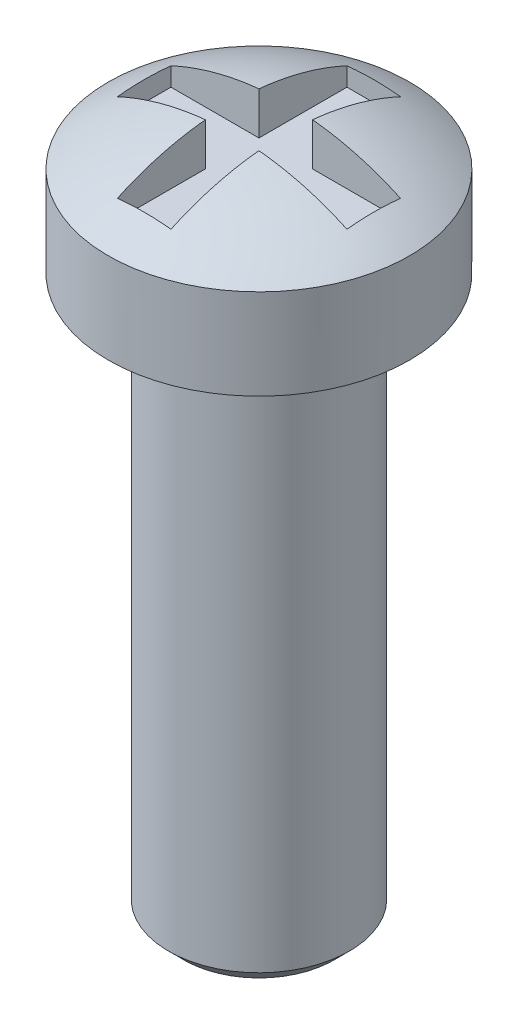
ISO-10303-21;
HEADER;
FILE_DESCRIPTION(('STEP AP214'),'2;1');
FILE_NAME('part.step','',(''),(''),'','','');
FILE_SCHEMA(('AUTOMOTIVE_DESIGN { 1 0 10303 214 1 1 1 1 }'));
ENDSEC;
DATA;
#1=APPLICATION_CONTEXT('core data for automotive mechanical design processes');
#2=APPLICATION_PROTOCOL_DEFINITION('international standard','automotive_design',2000,#1);
#3=PRODUCT_CONTEXT('',#1,'mechanical');
#4=PRODUCT('Part','Part','',(#3));
#5=PRODUCT_RELATED_PRODUCT_CATEGORY('part','',(#4));
#6=PRODUCT_DEFINITION_FORMATION('','',#4);
#7=PRODUCT_DEFINITION_CONTEXT('part definition',#1,'design');
#8=PRODUCT_DEFINITION('design','',#6,#7);
#9=PRODUCT_DEFINITION_SHAPE('','',#8);
#10=(LENGTH_UNIT() NAMED_UNIT(*) SI_UNIT(.MILLI.,.METRE.));
#11=(NAMED_UNIT(*) PLANE_ANGLE_UNIT() SI_UNIT($,.RADIAN.));
#12=(NAMED_UNIT(*) SI_UNIT($,.STERADIAN.) SOLID_ANGLE_UNIT());
#13=UNCERTAINTY_MEASURE_WITH_UNIT(LENGTH_MEASURE(1.E-05),#10,'distance_accuracy_value','');
#14=(GEOMETRIC_REPRESENTATION_CONTEXT(3) GLOBAL_UNCERTAINTY_ASSIGNED_CONTEXT((#13)) GLOBAL_UNIT_ASSIGNED_CONTEXT((#10,
#11,#12)) REPRESENTATION_CONTEXT('',''));
#15=CARTESIAN_POINT('',(0.,0.,0.));
#16=DIRECTION('',(0.,0.,1.));
#17=DIRECTION('',(1.,0.,0.));
#18=AXIS2_PLACEMENT_3D('',#15,#16,#17);
#19=CARTESIAN_POINT('',(-0.4445,-0.750000000000003,-1.905));
#20=DIRECTION('',(-1.,0.,0.));
#21=DIRECTION('',(0.,0.,1.));
#22=AXIS2_PLACEMENT_3D('',#19,#20,#21);
#23=PLANE('',#22);
#24=DIRECTION('',(0.,0.,1.));
#25=VECTOR('',#24,1.);
#26=CARTESIAN_POINT('',(-0.4445,-0.750000000000003,-1.905));
#27=LINE('',#26,#25);
#28=CARTESIAN_POINT('',(-0.4445,-0.750000000000003,0.444499999999999));
#29=VERTEX_POINT('',#28);
#30=CARTESIAN_POINT('',(-0.4445,-0.750000000000003,1.905));
#31=VERTEX_POINT('',#30);
#32=EDGE_CURVE('E206',#29,#31,#27,.T.);
#33=ORIENTED_EDGE('',*,*,#32,.F.);
#34=DIRECTION('',(0.,1.,0.));
#35=VECTOR('',#34,1.);
#36=CARTESIAN_POINT('',(-0.4445,-0.750000000000003,0.4445));
#37=LINE('',#36,#35);
#38=CARTESIAN_POINT('',(-0.4445,-0.0437142868485894,0.4445));
#39=VERTEX_POINT('',#38);
#40=EDGE_CURVE('E143',#29,#39,#37,.T.);
#41=ORIENTED_EDGE('',*,*,#40,.T.);
#42=CARTESIAN_POINT('',(-0.4445,-4.54166666666666,0.));
#43=DIRECTION('',(-1.,0.,0.));
#44=DIRECTION('',(0.,0.,1.));
#45=AXIS2_PLACEMENT_3D('',#42,#43,#44);
#46=CIRCLE('',#45,4.51986237192141);
#47=CARTESIAN_POINT('',(-0.4445,-0.442870396892929,1.905));
#48=VERTEX_POINT('',#47);
#49=EDGE_CURVE('E248',#48,#39,#46,.T.);
#50=ORIENTED_EDGE('',*,*,#49,.F.);
#51=DIRECTION('',(0.,-1.,0.));
#52=VECTOR('',#51,1.);
#53=CARTESIAN_POINT('',(-0.4445,-0.750000000000003,1.905));
#54=LINE('',#53,#52);
#55=EDGE_CURVE('E207',#48,#31,#54,.T.);
#56=ORIENTED_EDGE('',*,*,#55,.T.);
#57=EDGE_LOOP('',(#33,#41,#50,#56));
#58=FACE_BOUND('',#57,.T.);
#59=ADVANCED_FACE('F40',(#58),#23,.F.);
#60=CARTESIAN_POINT('',(0.4445,-0.750000000000003,-1.905));
#61=DIRECTION('',(1.,0.,0.));
#62=DIRECTION('',(0.,0.,-1.));
#63=AXIS2_PLACEMENT_3D('',#60,#61,#62);
#64=PLANE('',#63);
#65=CARTESIAN_POINT('',(0.4445,-4.54166666666666,0.));
#66=DIRECTION('',(1.,0.,0.));
#67=DIRECTION('',(0.,0.,-1.));
#68=AXIS2_PLACEMENT_3D('',#65,#66,#67);
#69=CIRCLE('',#68,4.51986237192141);
#70=CARTESIAN_POINT('',(0.4445,-0.0437142868485894,0.4445));
#71=VERTEX_POINT('',#70);
#72=CARTESIAN_POINT('',(0.4445,-0.442870396892929,1.905));
#73=VERTEX_POINT('',#72);
#74=EDGE_CURVE('E242',#71,#73,#69,.T.);
#75=ORIENTED_EDGE('',*,*,#74,.F.);
#76=DIRECTION('',(0.,-1.,0.));
#77=VECTOR('',#76,1.);
#78=CARTESIAN_POINT('',(0.4445,-0.750000000000003,0.4445));
#79=LINE('',#78,#77);
#80=CARTESIAN_POINT('',(0.444499999999999,-0.750000000000002,0.4445));
#81=VERTEX_POINT('',#80);
#82=EDGE_CURVE('E183',#71,#81,#79,.T.);
#83=ORIENTED_EDGE('',*,*,#82,.T.);
#84=DIRECTION('',(0.,0.,1.));
#85=VECTOR('',#84,1.);
#86=CARTESIAN_POINT('',(0.4445,-0.750000000000003,-1.905));
#87=LINE('',#86,#85);
#88=CARTESIAN_POINT('',(0.4445,-0.750000000000003,1.905));
#89=VERTEX_POINT('',#88);
#90=EDGE_CURVE('E223',#81,#89,#87,.T.);
#91=ORIENTED_EDGE('',*,*,#90,.T.);
#92=DIRECTION('',(0.,1.,0.));
#93=VECTOR('',#92,1.);
#94=CARTESIAN_POINT('',(0.4445,-0.750000000000003,1.905));
#95=LINE('',#94,#93);
#96=EDGE_CURVE('E198',#89,#73,#95,.T.);
#97=ORIENTED_EDGE('',*,*,#96,.T.);
#98=EDGE_LOOP('',(#75,#83,#91,#97));
#99=FACE_BOUND('',#98,.T.);
#100=ADVANCED_FACE('F278',(#99),#64,.F.);
#101=CARTESIAN_POINT('',(0.,-4.54166666666666,0.));
#102=DIRECTION('',(0.,1.,0.));
#103=DIRECTION('',(1.,0.,0.));
#104=AXIS2_PLACEMENT_3D('',#101,#102,#103);
#105=SPHERICAL_SURFACE('',#104,4.54166666666666);
#106=ORIENTED_EDGE('',*,*,#49,.T.);
#107=CARTESIAN_POINT('',(0.,-4.54166666666666,0.4445));
#108=DIRECTION('',(0.,0.,1.));
#109=DIRECTION('',(1.,0.,0.));
#110=AXIS2_PLACEMENT_3D('',#107,#108,#109);
#111=CIRCLE('',#110,4.51986237192141);
#112=CARTESIAN_POINT('',(-1.905,-0.442870396892929,0.4445));
#113=VERTEX_POINT('',#112);
#114=EDGE_CURVE('E191',#39,#113,#111,.T.);
#115=ORIENTED_EDGE('',*,*,#114,.T.);
#116=CARTESIAN_POINT('',(-1.905,-4.54166666666666,0.));
#117=DIRECTION('',(-1.,0.,0.));
#118=DIRECTION('',(0.,0.,1.));
#119=AXIS2_PLACEMENT_3D('',#116,#117,#118);
#120=CIRCLE('',#119,4.12282804772537);
#121=CARTESIAN_POINT('',(-1.905,-0.442870396892929,-0.4445));
#122=VERTEX_POINT('',#121);
#123=EDGE_CURVE('E135',#113,#122,#120,.T.);
#124=ORIENTED_EDGE('',*,*,#123,.T.);
#125=CARTESIAN_POINT('',(0.,-4.54166666666666,-0.4445));
#126=DIRECTION('',(0.,0.,-1.));
#127=DIRECTION('',(-1.,0.,0.));
#128=AXIS2_PLACEMENT_3D('',#125,#126,#127);
#129=CIRCLE('',#128,4.51986237192141);
#130=CARTESIAN_POINT('',(-0.4445,-0.0437142868485894,-0.4445));
#131=VERTEX_POINT('',#130);
#132=EDGE_CURVE('E179',#122,#131,#129,.T.);
#133=ORIENTED_EDGE('',*,*,#132,.T.);
#134=CARTESIAN_POINT('',(-0.4445,-0.442870396892929,-1.905));
#135=VERTEX_POINT('',#134);
#136=EDGE_CURVE('E247',#131,#135,#46,.T.);
#137=ORIENTED_EDGE('',*,*,#136,.T.);
#138=CARTESIAN_POINT('',(0.,-4.54166666666666,-1.905));
#139=DIRECTION('',(0.,0.,-1.));
#140=DIRECTION('',(-1.,0.,0.));
#141=AXIS2_PLACEMENT_3D('',#138,#139,#140);
#142=CIRCLE('',#141,4.12282804772537);
#143=CARTESIAN_POINT('',(0.4445,-0.442870396892929,-1.905));
#144=VERTEX_POINT('',#143);
#145=EDGE_CURVE('E252',#135,#144,#142,.T.);
#146=ORIENTED_EDGE('',*,*,#145,.T.);
#147=CARTESIAN_POINT('',(0.4445,-0.0437142868485894,-0.4445));
#148=VERTEX_POINT('',#147);
#149=EDGE_CURVE('E243',#144,#148,#69,.T.);
#150=ORIENTED_EDGE('',*,*,#149,.T.);
#151=CARTESIAN_POINT('',(1.905,-0.442870396892929,-0.4445));
#152=VERTEX_POINT('',#151);
#153=EDGE_CURVE('E174',#148,#152,#129,.T.);
#154=ORIENTED_EDGE('',*,*,#153,.T.);
#155=CARTESIAN_POINT('',(1.905,-4.54166666666666,0.));
#156=DIRECTION('',(-1.,0.,0.));
#157=DIRECTION('',(0.,0.,1.));
#158=AXIS2_PLACEMENT_3D('',#155,#156,#157);
#159=CIRCLE('',#158,4.12282804772537);
#160=CARTESIAN_POINT('',(1.905,-0.442870396892929,0.4445));
#161=VERTEX_POINT('',#160);
#162=EDGE_CURVE('E256',#161,#152,#159,.T.);
#163=ORIENTED_EDGE('',*,*,#162,.F.);
#164=EDGE_CURVE('E187',#161,#71,#111,.T.);
#165=ORIENTED_EDGE('',*,*,#164,.T.);
#166=ORIENTED_EDGE('',*,*,#74,.T.);
#167=CARTESIAN_POINT('',(0.,-4.54166666666666,1.905));
#168=DIRECTION('',(0.,0.,-1.));
#169=DIRECTION('',(-1.,0.,0.));
#170=AXIS2_PLACEMENT_3D('',#167,#168,#169);
#171=CIRCLE('',#170,4.12282804772537);
#172=EDGE_CURVE('E238',#48,#73,#171,.T.);
#173=ORIENTED_EDGE('',*,*,#172,.F.);
#174=EDGE_LOOP('',(#106,#115,#124,#133,#137,#146,#150,#154,#163,#165,#166,#173));
#175=FACE_BOUND('',#174,.T.);
#176=CARTESIAN_POINT('',(0.,-0.750000000000002,0.));
#177=DIRECTION('',(0.,1.,0.));
#178=DIRECTION('',(-1.,0.,0.));
#179=AXIS2_PLACEMENT_3D('',#176,#177,#178);
#180=CIRCLE('',#179,2.5);
#181=CARTESIAN_POINT('',(-2.5,-0.750000000000003,0.));
#182=VERTEX_POINT('',#181);
#183=EDGE_CURVE('E234',#182,#182,#180,.T.);
#184=ORIENTED_EDGE('',*,*,#183,.T.);
#185=EDGE_LOOP('',(#184));
#186=FACE_BOUND('',#185,.T.);
#187=ADVANCED_FACE('F285',(#175,#186),#105,.T.);
#188=CARTESIAN_POINT('',(0.,0.,0.));
#189=DIRECTION('',(0.,1.,0.));
#190=DIRECTION('',(-1.,0.,0.));
#191=AXIS2_PLACEMENT_3D('',#188,#189,#190);
#192=CYLINDRICAL_SURFACE('',#191,2.5);
#193=ORIENTED_EDGE('',*,*,#183,.F.);
#194=EDGE_LOOP('',(#193));
#195=FACE_BOUND('',#194,.T.);
#196=CARTESIAN_POINT('',(0.,-2.25,0.));
#197=DIRECTION('',(0.,1.,0.));
#198=DIRECTION('',(-1.,0.,0.));
#199=AXIS2_PLACEMENT_3D('',#196,#197,#198);
#200=CIRCLE('',#199,2.5);
#201=CARTESIAN_POINT('',(-2.5,-2.25,0.));
#202=VERTEX_POINT('',#201);
#203=EDGE_CURVE('E230',#202,#202,#200,.T.);
#204=ORIENTED_EDGE('',*,*,#203,.T.);
#205=EDGE_LOOP('',(#204));
#206=FACE_BOUND('',#205,.T.);
#207=ADVANCED_FACE('F423',(#195,#206),#192,.T.);
#208=CARTESIAN_POINT('',(1.5,-2.25,0.));
#209=DIRECTION('',(0.,1.,0.));
#210=DIRECTION('',(-1.,0.,0.));
#211=AXIS2_PLACEMENT_3D('',#208,#209,#210);
#212=PLANE('',#211);
#213=ORIENTED_EDGE('',*,*,#203,.F.);
#214=EDGE_LOOP('',(#213));
#215=FACE_BOUND('',#214,.T.);
#216=CARTESIAN_POINT('',(0.,-2.25,0.));
#217=DIRECTION('',(0.,1.,0.));
#218=DIRECTION('',(-1.,0.,0.));
#219=AXIS2_PLACEMENT_3D('',#216,#217,#218);
#220=CIRCLE('',#219,1.5);
#221=CARTESIAN_POINT('',(-1.5,-2.25,0.));
#222=VERTEX_POINT('',#221);
#223=EDGE_CURVE('E222',#222,#222,#220,.T.);
#224=ORIENTED_EDGE('',*,*,#223,.T.);
#225=EDGE_LOOP('',(#224));
#226=FACE_BOUND('',#225,.T.);
#227=ADVANCED_FACE('F368',(#215,#226),#212,.F.);
#228=CARTESIAN_POINT('',(0.,0.,0.));
#229=DIRECTION('',(0.,1.,0.));
#230=DIRECTION('',(-1.,0.,0.));
#231=AXIS2_PLACEMENT_3D('',#228,#229,#230);
#232=CYLINDRICAL_SURFACE('',#231,1.5);
#233=CARTESIAN_POINT('',(0.,-11.246,0.));
#234=DIRECTION('',(0.,1.,0.));
#235=DIRECTION('',(-1.,0.,0.));
#236=AXIS2_PLACEMENT_3D('',#233,#234,#235);
#237=CIRCLE('',#236,1.5);
#238=CARTESIAN_POINT('',(-1.5,-11.246,0.));
#239=VERTEX_POINT('',#238);
#240=EDGE_CURVE('E49',#239,#239,#237,.T.);
#241=ORIENTED_EDGE('',*,*,#240,.T.);
#242=EDGE_LOOP('',(#241));
#243=FACE_BOUND('',#242,.T.);
#244=ORIENTED_EDGE('',*,*,#223,.F.);
#245=EDGE_LOOP('',(#244));
#246=FACE_BOUND('',#245,.T.);
#247=ADVANCED_FACE('F264',(#243,#246),#232,.T.);
#248=CARTESIAN_POINT('',(0.,-11.5,0.));
#249=DIRECTION('',(0.,1.,0.));
#250=DIRECTION('',(-1.,0.,0.));
#251=AXIS2_PLACEMENT_3D('',#248,#249,#250);
#252=PLANE('',#251);
#253=CARTESIAN_POINT('',(0.,-11.5,0.));
#254=DIRECTION('',(0.,1.,0.));
#255=DIRECTION('',(-1.,0.,0.));
#256=AXIS2_PLACEMENT_3D('',#253,#254,#255);
#257=CIRCLE('',#256,1.246);
#258=CARTESIAN_POINT('',(-1.246,-11.5,0.));
#259=VERTEX_POINT('',#258);
#260=EDGE_CURVE('E11',#259,#259,#257,.F.);
#261=ORIENTED_EDGE('',*,*,#260,.T.);
#262=EDGE_LOOP('',(#261));
#263=FACE_BOUND('',#262,.T.);
#264=ADVANCED_FACE('F292',(#263),#252,.F.);
#265=ORIENTED_EDGE('',*,*,#136,.F.);
#266=DIRECTION('',(0.,-1.,0.));
#267=VECTOR('',#266,1.);
#268=CARTESIAN_POINT('',(-0.4445,-0.750000000000003,-0.4445));
#269=LINE('',#268,#267);
#270=CARTESIAN_POINT('',(-0.444500000000001,-0.750000000000002,-0.4445));
#271=VERTEX_POINT('',#270);
#272=EDGE_CURVE('E178',#131,#271,#269,.T.);
#273=ORIENTED_EDGE('',*,*,#272,.T.);
#274=CARTESIAN_POINT('',(-0.4445,-0.750000000000003,-1.905));
#275=VERTEX_POINT('',#274);
#276=EDGE_CURVE('E224',#275,#271,#27,.T.);
#277=ORIENTED_EDGE('',*,*,#276,.F.);
#278=DIRECTION('',(0.,-1.,0.));
#279=VECTOR('',#278,1.);
#280=CARTESIAN_POINT('',(-0.4445,-0.750000000000003,-1.905));
#281=LINE('',#280,#279);
#282=EDGE_CURVE('E194',#135,#275,#281,.T.);
#283=ORIENTED_EDGE('',*,*,#282,.F.);
#284=EDGE_LOOP('',(#265,#273,#277,#283));
#285=FACE_BOUND('',#284,.T.);
#286=ADVANCED_FACE('F281',(#285),#23,.F.);
#287=CARTESIAN_POINT('',(0.4445,-0.750000000000003,-1.905));
#288=VERTEX_POINT('',#287);
#289=CARTESIAN_POINT('',(0.4445,-0.750000000000003,-0.444500000000001));
#290=VERTEX_POINT('',#289);
#291=EDGE_CURVE('E218',#288,#290,#87,.T.);
#292=ORIENTED_EDGE('',*,*,#291,.T.);
#293=DIRECTION('',(0.,1.,0.));
#294=VECTOR('',#293,1.);
#295=CARTESIAN_POINT('',(0.4445,-0.750000000000003,-0.4445));
#296=LINE('',#295,#294);
#297=EDGE_CURVE('E169',#290,#148,#296,.T.);
#298=ORIENTED_EDGE('',*,*,#297,.T.);
#299=ORIENTED_EDGE('',*,*,#149,.F.);
#300=DIRECTION('',(0.,1.,0.));
#301=VECTOR('',#300,1.);
#302=CARTESIAN_POINT('',(0.4445,-0.750000000000003,-1.905));
#303=LINE('',#302,#301);
#304=EDGE_CURVE('E202',#288,#144,#303,.T.);
#305=ORIENTED_EDGE('',*,*,#304,.F.);
#306=EDGE_LOOP('',(#292,#298,#299,#305));
#307=FACE_BOUND('',#306,.T.);
#308=ADVANCED_FACE('F288',(#307),#64,.F.);
#309=CARTESIAN_POINT('',(-0.4445,0.898266189803033,-1.905));
#310=DIRECTION('',(0.,0.,-1.));
#311=DIRECTION('',(-1.,0.,0.));
#312=AXIS2_PLACEMENT_3D('',#309,#310,#311);
#313=PLANE('',#312);
#314=ORIENTED_EDGE('',*,*,#282,.T.);
#315=DIRECTION('',(1.,0.,0.));
#316=VECTOR('',#315,1.);
#317=CARTESIAN_POINT('',(-0.4445,-0.750000000000003,-1.905));
#318=LINE('',#317,#316);
#319=EDGE_CURVE('E197',#275,#288,#318,.T.);
#320=ORIENTED_EDGE('',*,*,#319,.T.);
#321=ORIENTED_EDGE('',*,*,#304,.T.);
#322=ORIENTED_EDGE('',*,*,#145,.F.);
#323=EDGE_LOOP('',(#314,#320,#321,#322));
#324=FACE_BOUND('',#323,.T.);
#325=ADVANCED_FACE('F298',(#324),#313,.F.);
#326=CARTESIAN_POINT('',(-0.4445,0.898266189803033,1.905));
#327=DIRECTION('',(0.,0.,-1.));
#328=DIRECTION('',(-1.,0.,0.));
#329=AXIS2_PLACEMENT_3D('',#326,#327,#328);
#330=PLANE('',#329);
#331=ORIENTED_EDGE('',*,*,#172,.T.);
#332=ORIENTED_EDGE('',*,*,#96,.F.);
#333=DIRECTION('',(1.,0.,0.));
#334=VECTOR('',#333,1.);
#335=CARTESIAN_POINT('',(-0.4445,-0.750000000000003,1.905));
#336=LINE('',#335,#334);
#337=EDGE_CURVE('E211',#31,#89,#336,.T.);
#338=ORIENTED_EDGE('',*,*,#337,.F.);
#339=ORIENTED_EDGE('',*,*,#55,.F.);
#340=EDGE_LOOP('',(#331,#332,#338,#339));
#341=FACE_BOUND('',#340,.T.);
#342=ADVANCED_FACE('F330',(#341),#330,.T.);
#343=CARTESIAN_POINT('',(-0.4445,-0.750000000000003,-1.905));
#344=DIRECTION('',(0.,-1.,0.));
#345=DIRECTION('',(0.,0.,-1.));
#346=AXIS2_PLACEMENT_3D('',#343,#344,#345);
#347=PLANE('',#346);
#348=ORIENTED_EDGE('',*,*,#276,.T.);
#349=DIRECTION('',(1.,0.,0.));
#350=VECTOR('',#349,1.);
#351=CARTESIAN_POINT('',(-1.905,-0.750000000000002,-0.4445));
#352=LINE('',#351,#350);
#353=CARTESIAN_POINT('',(-1.905,-0.750000000000002,-0.4445));
#354=VERTEX_POINT('',#353);
#355=EDGE_CURVE('E150',#354,#271,#352,.T.);
#356=ORIENTED_EDGE('',*,*,#355,.F.);
#357=DIRECTION('',(0.,0.,-1.));
#358=VECTOR('',#357,1.);
#359=CARTESIAN_POINT('',(-1.905,-0.750000000000002,0.4445));
#360=LINE('',#359,#358);
#361=CARTESIAN_POINT('',(-1.905,-0.750000000000002,0.4445));
#362=VERTEX_POINT('',#361);
#363=EDGE_CURVE('E133',#362,#354,#360,.T.);
#364=ORIENTED_EDGE('',*,*,#363,.F.);
#365=DIRECTION('',(1.,0.,0.));
#366=VECTOR('',#365,1.);
#367=CARTESIAN_POINT('',(-1.905,-0.750000000000002,0.4445));
#368=LINE('',#367,#366);
#369=EDGE_CURVE('E56',#362,#29,#368,.T.);
#370=ORIENTED_EDGE('',*,*,#369,.T.);
#371=ORIENTED_EDGE('',*,*,#32,.T.);
#372=ORIENTED_EDGE('',*,*,#337,.T.);
#373=ORIENTED_EDGE('',*,*,#90,.F.);
#374=CARTESIAN_POINT('',(1.905,-0.750000000000002,0.4445));
#375=VERTEX_POINT('',#374);
#376=EDGE_CURVE('E146',#81,#375,#368,.T.);
#377=ORIENTED_EDGE('',*,*,#376,.T.);
#378=DIRECTION('',(0.,0.,-1.));
#379=VECTOR('',#378,1.);
#380=CARTESIAN_POINT('',(1.905,-0.750000000000002,0.4445));
#381=LINE('',#380,#379);
#382=CARTESIAN_POINT('',(1.905,-0.750000000000002,-0.4445));
#383=VERTEX_POINT('',#382);
#384=EDGE_CURVE('E162',#375,#383,#381,.T.);
#385=ORIENTED_EDGE('',*,*,#384,.T.);
#386=EDGE_CURVE('E63',#290,#383,#352,.T.);
#387=ORIENTED_EDGE('',*,*,#386,.F.);
#388=ORIENTED_EDGE('',*,*,#291,.F.);
#389=ORIENTED_EDGE('',*,*,#319,.F.);
#390=EDGE_LOOP('',(#348,#356,#364,#370,#371,#372,#373,#377,#385,#387,#388,#389));
#391=FACE_BOUND('',#390,.T.);
#392=ADVANCED_FACE('F149',(#391),#347,.F.);
#393=CARTESIAN_POINT('',(-1.905,-0.750000000000002,-0.4445));
#394=DIRECTION('',(0.,0.,-1.));
#395=DIRECTION('',(-1.,0.,0.));
#396=AXIS2_PLACEMENT_3D('',#393,#394,#395);
#397=PLANE('',#396);
#398=ORIENTED_EDGE('',*,*,#297,.F.);
#399=ORIENTED_EDGE('',*,*,#386,.T.);
#400=DIRECTION('',(0.,1.,0.));
#401=VECTOR('',#400,1.);
#402=CARTESIAN_POINT('',(1.905,-0.750000000000002,-0.4445));
#403=LINE('',#402,#401);
#404=EDGE_CURVE('E139',#383,#152,#403,.T.);
#405=ORIENTED_EDGE('',*,*,#404,.T.);
#406=ORIENTED_EDGE('',*,*,#153,.F.);
#407=EDGE_LOOP('',(#398,#399,#405,#406));
#408=FACE_BOUND('',#407,.T.);
#409=ADVANCED_FACE('F275',(#408),#397,.F.);
#410=CARTESIAN_POINT('',(-1.905,-0.750000000000002,0.4445));
#411=DIRECTION('',(0.,0.,1.));
#412=DIRECTION('',(1.,0.,0.));
#413=AXIS2_PLACEMENT_3D('',#410,#411,#412);
#414=PLANE('',#413);
#415=DIRECTION('',(0.,-1.,0.));
#416=VECTOR('',#415,1.);
#417=CARTESIAN_POINT('',(1.905,-0.750000000000002,0.4445));
#418=LINE('',#417,#416);
#419=EDGE_CURVE('E158',#161,#375,#418,.T.);
#420=ORIENTED_EDGE('',*,*,#419,.T.);
#421=ORIENTED_EDGE('',*,*,#376,.F.);
#422=ORIENTED_EDGE('',*,*,#82,.F.);
#423=ORIENTED_EDGE('',*,*,#164,.F.);
#424=EDGE_LOOP('',(#420,#421,#422,#423));
#425=FACE_BOUND('',#424,.T.);
#426=ADVANCED_FACE('F319',(#425),#414,.F.);
#427=CARTESIAN_POINT('',(1.905,1.6461996597617,0.4445));
#428=DIRECTION('',(-1.,0.,0.));
#429=DIRECTION('',(0.,0.,1.));
#430=AXIS2_PLACEMENT_3D('',#427,#428,#429);
#431=PLANE('',#430);
#432=ORIENTED_EDGE('',*,*,#162,.T.);
#433=ORIENTED_EDGE('',*,*,#404,.F.);
#434=ORIENTED_EDGE('',*,*,#384,.F.);
#435=ORIENTED_EDGE('',*,*,#419,.F.);
#436=EDGE_LOOP('',(#432,#433,#434,#435));
#437=FACE_BOUND('',#436,.T.);
#438=ADVANCED_FACE('F323',(#437),#431,.T.);
#439=CARTESIAN_POINT('',(-1.905,1.6461996597617,0.4445));
#440=DIRECTION('',(-1.,0.,0.));
#441=DIRECTION('',(0.,0.,1.));
#442=AXIS2_PLACEMENT_3D('',#439,#440,#441);
#443=PLANE('',#442);
#444=DIRECTION('',(0.,-1.,0.));
#445=VECTOR('',#444,1.);
#446=CARTESIAN_POINT('',(-1.905,-0.750000000000002,0.4445));
#447=LINE('',#446,#445);
#448=EDGE_CURVE('E130',#113,#362,#447,.T.);
#449=ORIENTED_EDGE('',*,*,#448,.T.);
#450=ORIENTED_EDGE('',*,*,#363,.T.);
#451=DIRECTION('',(0.,1.,0.));
#452=VECTOR('',#451,1.);
#453=CARTESIAN_POINT('',(-1.905,-0.750000000000002,-0.4445));
#454=LINE('',#453,#452);
#455=EDGE_CURVE('E153',#354,#122,#454,.T.);
#456=ORIENTED_EDGE('',*,*,#455,.T.);
#457=ORIENTED_EDGE('',*,*,#123,.F.);
#458=EDGE_LOOP('',(#449,#450,#456,#457));
#459=FACE_BOUND('',#458,.T.);
#460=ADVANCED_FACE('F131',(#459),#443,.F.);
#461=ORIENTED_EDGE('',*,*,#40,.F.);
#462=ORIENTED_EDGE('',*,*,#369,.F.);
#463=ORIENTED_EDGE('',*,*,#448,.F.);
#464=ORIENTED_EDGE('',*,*,#114,.F.);
#465=EDGE_LOOP('',(#461,#462,#463,#464));
#466=FACE_BOUND('',#465,.T.);
#467=ADVANCED_FACE('F141',(#466),#414,.F.);
#468=ORIENTED_EDGE('',*,*,#455,.F.);
#469=ORIENTED_EDGE('',*,*,#355,.T.);
#470=ORIENTED_EDGE('',*,*,#272,.F.);
#471=ORIENTED_EDGE('',*,*,#132,.F.);
#472=EDGE_LOOP('',(#468,#469,#470,#471));
#473=FACE_BOUND('',#472,.T.);
#474=ADVANCED_FACE('F268',(#473),#397,.F.);
#475=CARTESIAN_POINT('',(0.,-11.246,0.));
#476=DIRECTION('',(0.,1.,0.));
#477=DIRECTION('',(-1.,0.,0.));
#478=AXIS2_PLACEMENT_3D('',#475,#476,#477);
#479=CONICAL_SURFACE('',#478,1.5,0.785398163397454);
#480=ORIENTED_EDGE('',*,*,#260,.F.);
#481=EDGE_LOOP('',(#480));
#482=FACE_BOUND('',#481,.T.);
#483=ORIENTED_EDGE('',*,*,#240,.F.);
#484=EDGE_LOOP('',(#483));
#485=FACE_BOUND('',#484,.T.);
#486=ADVANCED_FACE('F42',(#482,#485),#479,.T.);
#487=CLOSED_SHELL('',(#59,#100,#187,#207,#227,#247,#264,#286,#308,#325,#342,#392,#409,#426,#438,
#460,#467,#474,#486));
#488=MANIFOLD_SOLID_BREP('B2',#487);
#489=ADVANCED_BREP_SHAPE_REPRESENTATION('',(#18,#488),#14);
#490=SHAPE_DEFINITION_REPRESENTATION(#9,#489);
ENDSEC;
END-ISO-10303-21;
